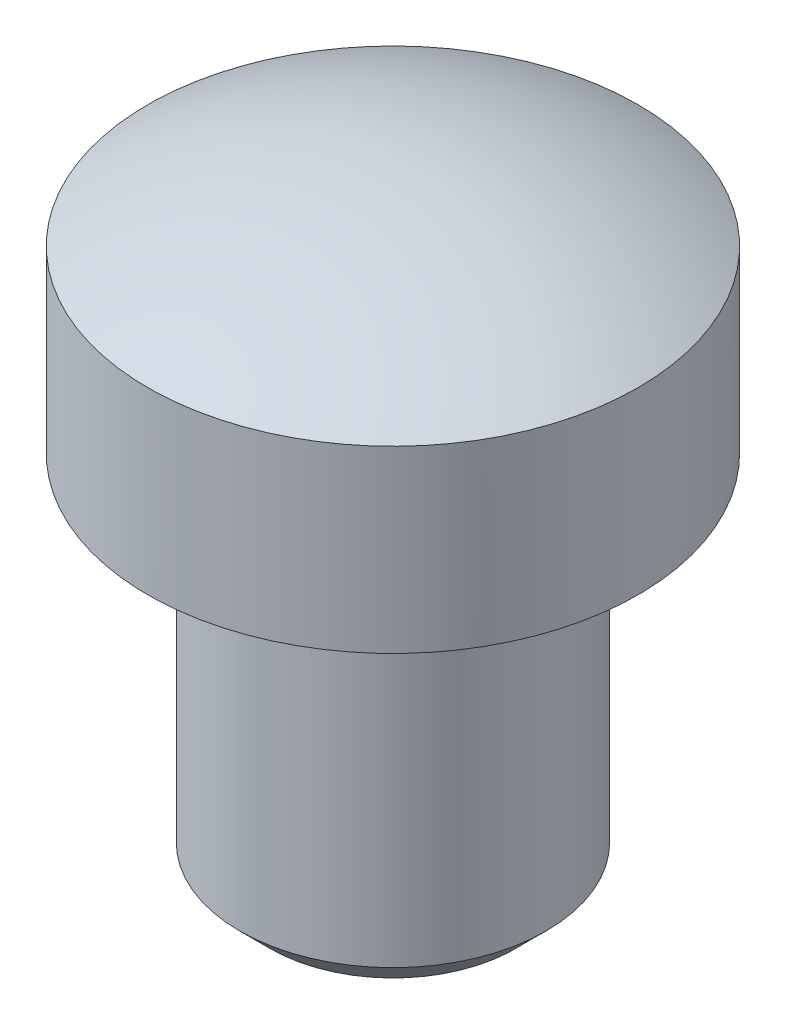
ISO-10303-21;
HEADER;
FILE_DESCRIPTION(('STEP AP214'),'2;1');
FILE_NAME('part.step','',(''),(''),'','','');
FILE_SCHEMA(('AUTOMOTIVE_DESIGN { 1 0 10303 214 1 1 1 1 }'));
ENDSEC;
DATA;
#1=APPLICATION_CONTEXT('core data for automotive mechanical design processes');
#2=APPLICATION_PROTOCOL_DEFINITION('international standard','automotive_design',2000,#1);
#3=PRODUCT_CONTEXT('',#1,'mechanical');
#4=PRODUCT('Part','Part','',(#3));
#5=PRODUCT_RELATED_PRODUCT_CATEGORY('part','',(#4));
#6=PRODUCT_DEFINITION_FORMATION('','',#4);
#7=PRODUCT_DEFINITION_CONTEXT('part definition',#1,'design');
#8=PRODUCT_DEFINITION('design','',#6,#7);
#9=PRODUCT_DEFINITION_SHAPE('','',#8);
#10=(LENGTH_UNIT() NAMED_UNIT(*) SI_UNIT(.MILLI.,.METRE.));
#11=(NAMED_UNIT(*) PLANE_ANGLE_UNIT() SI_UNIT($,.RADIAN.));
#12=(NAMED_UNIT(*) SI_UNIT($,.STERADIAN.) SOLID_ANGLE_UNIT());
#13=UNCERTAINTY_MEASURE_WITH_UNIT(LENGTH_MEASURE(1.E-05),#10,'distance_accuracy_value','');
#14=(GEOMETRIC_REPRESENTATION_CONTEXT(3) GLOBAL_UNCERTAINTY_ASSIGNED_CONTEXT((#13)) GLOBAL_UNIT_ASSIGNED_CONTEXT((#10,
#11,#12)) REPRESENTATION_CONTEXT('',''));
#15=CARTESIAN_POINT('',(0.,0.,0.));
#16=DIRECTION('',(0.,0.,1.));
#17=DIRECTION('',(1.,0.,0.));
#18=AXIS2_PLACEMENT_3D('',#15,#16,#17);
#19=CARTESIAN_POINT('',(0.,-16.,0.));
#20=DIRECTION('',(0.,-1.,0.));
#21=DIRECTION('',(1.,0.,0.));
#22=AXIS2_PLACEMENT_3D('',#19,#20,#21);
#23=SPHERICAL_SURFACE('',#22,16.);
#24=CARTESIAN_POINT('',(0.,-2.14359353944898,0.));
#25=DIRECTION('',(0.,-1.,0.));
#26=DIRECTION('',(0.,0.,-1.));
#27=AXIS2_PLACEMENT_3D('',#24,#25,#26);
#28=CIRCLE('',#27,8.);
#29=CARTESIAN_POINT('',(0.,-2.14359353944898,-8.));
#30=VERTEX_POINT('',#29);
#31=EDGE_CURVE('E58',#30,#30,#28,.T.);
#32=ORIENTED_EDGE('',*,*,#31,.F.);
#33=EDGE_LOOP('',(#32));
#34=FACE_BOUND('',#33,.T.);
#35=ADVANCED_FACE('F32',(#34),#23,.T.);
#36=CARTESIAN_POINT('',(5.,-20.,0.));
#37=DIRECTION('',(0.,-1.,0.));
#38=DIRECTION('',(0.,0.,-1.));
#39=AXIS2_PLACEMENT_3D('',#36,#37,#38);
#40=PLANE('',#39);
#41=CARTESIAN_POINT('',(0.,-20.,0.));
#42=DIRECTION('',(0.,-1.,0.));
#43=DIRECTION('',(0.,0.,-1.));
#44=AXIS2_PLACEMENT_3D('',#41,#42,#43);
#45=CIRCLE('',#44,4.);
#46=CARTESIAN_POINT('',(0.,-20.,-4.));
#47=VERTEX_POINT('',#46);
#48=EDGE_CURVE('E43',#47,#47,#45,.T.);
#49=ORIENTED_EDGE('',*,*,#48,.T.);
#50=EDGE_LOOP('',(#49));
#51=FACE_BOUND('',#50,.T.);
#52=ADVANCED_FACE('F66',(#51),#40,.T.);
#53=CARTESIAN_POINT('',(0.,-20.,0.));
#54=DIRECTION('',(0.,-1.,0.));
#55=DIRECTION('',(0.,0.,-1.));
#56=AXIS2_PLACEMENT_3D('',#53,#54,#55);
#57=CYLINDRICAL_SURFACE('',#56,5.);
#58=CARTESIAN_POINT('',(0.,-19.,0.));
#59=DIRECTION('',(0.,-1.,0.));
#60=DIRECTION('',(0.,0.,-1.));
#61=AXIS2_PLACEMENT_3D('',#58,#59,#60);
#62=CIRCLE('',#61,5.);
#63=CARTESIAN_POINT('',(0.,-19.,-5.));
#64=VERTEX_POINT('',#63);
#65=EDGE_CURVE('E10',#64,#64,#62,.F.);
#66=ORIENTED_EDGE('',*,*,#65,.T.);
#67=EDGE_LOOP('',(#66));
#68=FACE_BOUND('',#67,.T.);
#69=CARTESIAN_POINT('',(0.,-10.,0.));
#70=DIRECTION('',(0.,1.,0.));
#71=DIRECTION('',(0.,0.,1.));
#72=AXIS2_PLACEMENT_3D('',#69,#70,#71);
#73=CIRCLE('',#72,5.);
#74=CARTESIAN_POINT('',(0.,-10.,5.));
#75=VERTEX_POINT('',#74);
#76=EDGE_CURVE('E39',#75,#75,#73,.F.);
#77=ORIENTED_EDGE('',*,*,#76,.T.);
#78=EDGE_LOOP('',(#77));
#79=FACE_BOUND('',#78,.T.);
#80=ADVANCED_FACE('F71',(#68,#79),#57,.T.);
#81=CARTESIAN_POINT('',(0.,-20.,0.));
#82=DIRECTION('',(0.,-1.,0.));
#83=DIRECTION('',(0.,0.,-1.));
#84=AXIS2_PLACEMENT_3D('',#81,#82,#83);
#85=CYLINDRICAL_SURFACE('',#84,4.);
#86=CARTESIAN_POINT('',(0.,-8.,0.));
#87=DIRECTION('',(0.,-1.,0.));
#88=DIRECTION('',(0.,0.,-1.));
#89=AXIS2_PLACEMENT_3D('',#86,#87,#88);
#90=CIRCLE('',#89,4.);
#91=CARTESIAN_POINT('',(0.,-8.,-4.));
#92=VERTEX_POINT('',#91);
#93=EDGE_CURVE('E52',#92,#92,#90,.T.);
#94=ORIENTED_EDGE('',*,*,#93,.T.);
#95=EDGE_LOOP('',(#94));
#96=FACE_BOUND('',#95,.T.);
#97=CARTESIAN_POINT('',(0.,-9.,0.));
#98=DIRECTION('',(0.,-1.,0.));
#99=DIRECTION('',(0.,0.,-1.));
#100=AXIS2_PLACEMENT_3D('',#97,#98,#99);
#101=CIRCLE('',#100,4.);
#102=CARTESIAN_POINT('',(0.,-9.,-4.));
#103=VERTEX_POINT('',#102);
#104=EDGE_CURVE('E47',#103,#103,#101,.T.);
#105=ORIENTED_EDGE('',*,*,#104,.F.);
#106=EDGE_LOOP('',(#105));
#107=FACE_BOUND('',#106,.T.);
#108=ADVANCED_FACE('F90',(#96,#107),#85,.T.);
#109=CARTESIAN_POINT('',(8.,-8.,0.));
#110=DIRECTION('',(0.,-1.,0.));
#111=DIRECTION('',(0.,0.,-1.));
#112=AXIS2_PLACEMENT_3D('',#109,#110,#111);
#113=PLANE('',#112);
#114=CARTESIAN_POINT('',(0.,-8.,0.));
#115=DIRECTION('',(0.,-1.,0.));
#116=DIRECTION('',(0.,0.,-1.));
#117=AXIS2_PLACEMENT_3D('',#114,#115,#116);
#118=CIRCLE('',#117,8.);
#119=CARTESIAN_POINT('',(0.,-8.,-8.));
#120=VERTEX_POINT('',#119);
#121=EDGE_CURVE('E55',#120,#120,#118,.T.);
#122=ORIENTED_EDGE('',*,*,#121,.T.);
#123=EDGE_LOOP('',(#122));
#124=FACE_BOUND('',#123,.T.);
#125=ORIENTED_EDGE('',*,*,#93,.F.);
#126=EDGE_LOOP('',(#125));
#127=FACE_BOUND('',#126,.T.);
#128=ADVANCED_FACE('F83',(#124,#127),#113,.T.);
#129=CARTESIAN_POINT('',(0.,-20.,0.));
#130=DIRECTION('',(0.,-1.,0.));
#131=DIRECTION('',(0.,0.,-1.));
#132=AXIS2_PLACEMENT_3D('',#129,#130,#131);
#133=CYLINDRICAL_SURFACE('',#132,8.);
#134=ORIENTED_EDGE('',*,*,#31,.T.);
#135=EDGE_LOOP('',(#134));
#136=FACE_BOUND('',#135,.T.);
#137=ORIENTED_EDGE('',*,*,#121,.F.);
#138=EDGE_LOOP('',(#137));
#139=FACE_BOUND('',#138,.T.);
#140=ADVANCED_FACE('F62',(#136,#139),#133,.T.);
#141=CARTESIAN_POINT('',(0.,-20.,0.));
#142=DIRECTION('',(0.,1.,0.));
#143=DIRECTION('',(0.,0.,1.));
#144=AXIS2_PLACEMENT_3D('',#141,#142,#143);
#145=CONICAL_SURFACE('',#144,4.,0.785398163397447);
#146=ORIENTED_EDGE('',*,*,#65,.F.);
#147=EDGE_LOOP('',(#146));
#148=FACE_BOUND('',#147,.T.);
#149=ORIENTED_EDGE('',*,*,#48,.F.);
#150=EDGE_LOOP('',(#149));
#151=FACE_BOUND('',#150,.T.);
#152=ADVANCED_FACE('F75',(#148,#151),#145,.T.);
#153=CARTESIAN_POINT('',(0.,-10.,0.));
#154=DIRECTION('',(0.,-1.,0.));
#155=DIRECTION('',(0.,0.,-1.));
#156=AXIS2_PLACEMENT_3D('',#153,#154,#155);
#157=CONICAL_SURFACE('',#156,5.,0.785398163397452);
#158=ORIENTED_EDGE('',*,*,#104,.T.);
#159=EDGE_LOOP('',(#158));
#160=FACE_BOUND('',#159,.T.);
#161=ORIENTED_EDGE('',*,*,#76,.F.);
#162=EDGE_LOOP('',(#161));
#163=FACE_BOUND('',#162,.T.);
#164=ADVANCED_FACE('F34',(#160,#163),#157,.T.);
#165=CLOSED_SHELL('',(#35,#52,#80,#108,#128,#140,#152,#164));
#166=MANIFOLD_SOLID_BREP('B2',#165);
#167=ADVANCED_BREP_SHAPE_REPRESENTATION('',(#18,#166),#14);
#168=SHAPE_DEFINITION_REPRESENTATION(#9,#167);
ENDSEC;
END-ISO-10303-21;
